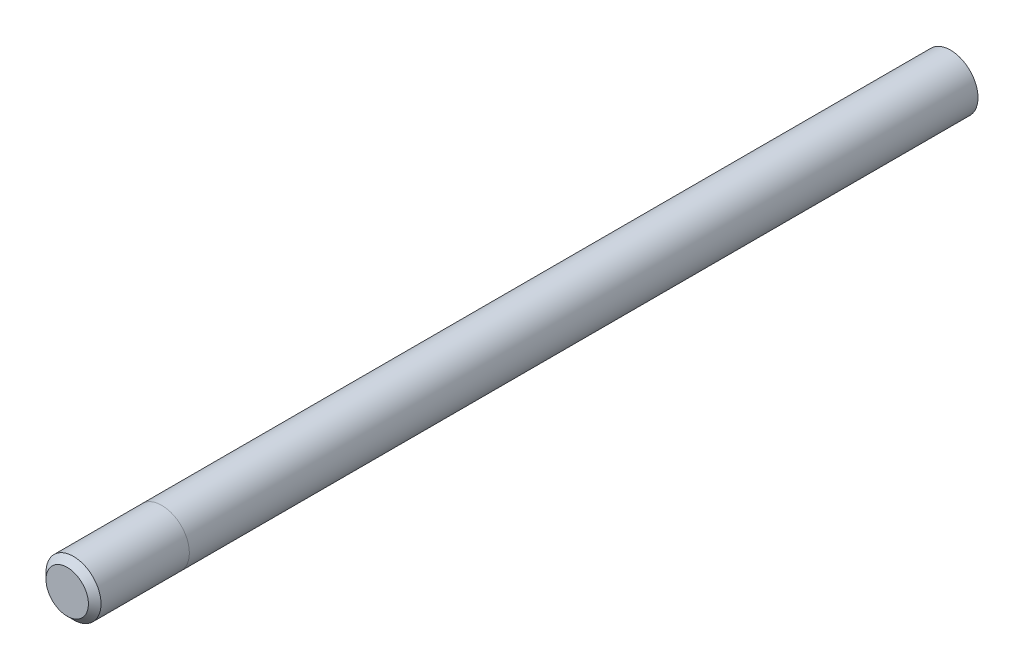
ISO-10303-21;
HEADER;
FILE_DESCRIPTION(('STEP AP214'),'2;1');
FILE_NAME('part.step','',(''),(''),'','','');
FILE_SCHEMA(('AUTOMOTIVE_DESIGN { 1 0 10303 214 1 1 1 1 }'));
ENDSEC;
DATA;
#1=APPLICATION_CONTEXT('core data for automotive mechanical design processes');
#2=APPLICATION_PROTOCOL_DEFINITION('international standard','automotive_design',2000,#1);
#3=PRODUCT_CONTEXT('',#1,'mechanical');
#4=PRODUCT('Part','Part','',(#3));
#5=PRODUCT_RELATED_PRODUCT_CATEGORY('part','',(#4));
#6=PRODUCT_DEFINITION_FORMATION('','',#4);
#7=PRODUCT_DEFINITION_CONTEXT('part definition',#1,'design');
#8=PRODUCT_DEFINITION('design','',#6,#7);
#9=PRODUCT_DEFINITION_SHAPE('','',#8);
#10=(LENGTH_UNIT() NAMED_UNIT(*) SI_UNIT(.MILLI.,.METRE.));
#11=(NAMED_UNIT(*) PLANE_ANGLE_UNIT() SI_UNIT($,.RADIAN.));
#12=(NAMED_UNIT(*) SI_UNIT($,.STERADIAN.) SOLID_ANGLE_UNIT());
#13=UNCERTAINTY_MEASURE_WITH_UNIT(LENGTH_MEASURE(1.E-05),#10,'distance_accuracy_value','');
#14=(GEOMETRIC_REPRESENTATION_CONTEXT(3) GLOBAL_UNCERTAINTY_ASSIGNED_CONTEXT((#13)) GLOBAL_UNIT_ASSIGNED_CONTEXT((#10,
#11,#12)) REPRESENTATION_CONTEXT('',''));
#15=CARTESIAN_POINT('',(0.,0.,0.));
#16=DIRECTION('',(0.,0.,1.));
#17=DIRECTION('',(1.,0.,0.));
#18=AXIS2_PLACEMENT_3D('',#15,#16,#17);
#19=CARTESIAN_POINT('',(0.,0.,177.8));
#20=DIRECTION('',(0.,0.,-1.));
#21=DIRECTION('',(-1.,0.,0.));
#22=AXIS2_PLACEMENT_3D('',#19,#20,#21);
#23=CYLINDRICAL_SURFACE('',#22,5.5372);
#24=CARTESIAN_POINT('',(0.,0.,176.53));
#25=DIRECTION('',(0.,0.,1.));
#26=DIRECTION('',(1.,0.,0.));
#27=AXIS2_PLACEMENT_3D('',#24,#25,#26);
#28=CIRCLE('',#27,5.5372);
#29=CARTESIAN_POINT('',(5.5372,0.,176.53));
#30=VERTEX_POINT('',#29);
#31=EDGE_CURVE('E11',#30,#30,#28,.F.);
#32=ORIENTED_EDGE('',*,*,#31,.T.);
#33=EDGE_LOOP('',(#32));
#34=FACE_BOUND('',#33,.T.);
#35=CARTESIAN_POINT('',(0.,0.,158.75));
#36=DIRECTION('',(0.,0.,1.));
#37=DIRECTION('',(1.,0.,0.));
#38=AXIS2_PLACEMENT_3D('',#35,#36,#37);
#39=CIRCLE('',#38,5.5372);
#40=CARTESIAN_POINT('',(5.5372,0.,158.75));
#41=VERTEX_POINT('',#40);
#42=EDGE_CURVE('E51',#41,#41,#39,.T.);
#43=ORIENTED_EDGE('',*,*,#42,.T.);
#44=EDGE_LOOP('',(#43));
#45=FACE_BOUND('',#44,.T.);
#46=ADVANCED_FACE('F40',(#34,#45),#23,.T.);
#47=CARTESIAN_POINT('',(0.,0.,177.8));
#48=DIRECTION('',(0.,0.,1.));
#49=DIRECTION('',(1.,0.,0.));
#50=AXIS2_PLACEMENT_3D('',#47,#48,#49);
#51=PLANE('',#50);
#52=CARTESIAN_POINT('',(0.,0.,177.8));
#53=DIRECTION('',(0.,0.,1.));
#54=DIRECTION('',(1.,0.,0.));
#55=AXIS2_PLACEMENT_3D('',#52,#53,#54);
#56=CIRCLE('',#55,4.26720000000002);
#57=CARTESIAN_POINT('',(4.26720000000002,0.,177.8));
#58=VERTEX_POINT('',#57);
#59=EDGE_CURVE('E47',#58,#58,#56,.T.);
#60=ORIENTED_EDGE('',*,*,#59,.T.);
#61=EDGE_LOOP('',(#60));
#62=FACE_BOUND('',#61,.T.);
#63=ADVANCED_FACE('F61',(#62),#51,.T.);
#64=CARTESIAN_POINT('',(0.,0.,158.75));
#65=DIRECTION('',(0.,0.,1.));
#66=DIRECTION('',(1.,0.,0.));
#67=AXIS2_PLACEMENT_3D('',#64,#65,#66);
#68=PLANE('',#67);
#69=ORIENTED_EDGE('',*,*,#42,.F.);
#70=EDGE_LOOP('',(#69));
#71=FACE_BOUND('',#70,.T.);
#72=ADVANCED_FACE('F59',(#71),#68,.F.);
#73=CARTESIAN_POINT('',(0.,0.,177.8));
#74=DIRECTION('',(0.,0.,-1.));
#75=DIRECTION('',(-1.,0.,0.));
#76=AXIS2_PLACEMENT_3D('',#73,#74,#75);
#77=CONICAL_SURFACE('',#76,4.26720000000002,0.785398163397442);
#78=ORIENTED_EDGE('',*,*,#31,.F.);
#79=EDGE_LOOP('',(#78));
#80=FACE_BOUND('',#79,.T.);
#81=ORIENTED_EDGE('',*,*,#59,.F.);
#82=EDGE_LOOP('',(#81));
#83=FACE_BOUND('',#82,.T.);
#84=ADVANCED_FACE('F42',(#80,#83),#77,.T.);
#85=CLOSED_SHELL('',(#46,#63,#72,#84));
#86=MANIFOLD_SOLID_BREP('B2',#85);
#87=CARTESIAN_POINT('',(0.,0.,158.75));
#88=DIRECTION('',(0.,0.,-1.));
#89=DIRECTION('',(-1.,0.,0.));
#90=AXIS2_PLACEMENT_3D('',#87,#88,#89);
#91=CYLINDRICAL_SURFACE('',#90,5.5372);
#92=CARTESIAN_POINT('',(0.,0.,158.75));
#93=DIRECTION('',(0.,0.,1.));
#94=DIRECTION('',(1.,0.,0.));
#95=AXIS2_PLACEMENT_3D('',#92,#93,#94);
#96=CIRCLE('',#95,5.5372);
#97=CARTESIAN_POINT('',(5.5372,0.,158.75));
#98=VERTEX_POINT('',#97);
#99=EDGE_CURVE('E39',#98,#98,#96,.T.);
#100=ORIENTED_EDGE('',*,*,#99,.F.);
#101=EDGE_LOOP('',(#100));
#102=FACE_BOUND('',#101,.T.);
#103=CARTESIAN_POINT('',(0.,0.,0.));
#104=DIRECTION('',(0.,0.,1.));
#105=DIRECTION('',(1.,0.,0.));
#106=AXIS2_PLACEMENT_3D('',#103,#104,#105);
#107=CIRCLE('',#106,5.5372);
#108=CARTESIAN_POINT('',(5.5372,0.,0.));
#109=VERTEX_POINT('',#108);
#110=EDGE_CURVE('E98',#109,#109,#107,.T.);
#111=ORIENTED_EDGE('',*,*,#110,.T.);
#112=EDGE_LOOP('',(#111));
#113=FACE_BOUND('',#112,.T.);
#114=ADVANCED_FACE('F95',(#102,#113),#91,.T.);
#115=CARTESIAN_POINT('',(0.,0.,158.75));
#116=DIRECTION('',(0.,0.,1.));
#117=DIRECTION('',(1.,0.,0.));
#118=AXIS2_PLACEMENT_3D('',#115,#116,#117);
#119=PLANE('',#118);
#120=ORIENTED_EDGE('',*,*,#99,.T.);
#121=EDGE_LOOP('',(#120));
#122=FACE_BOUND('',#121,.T.);
#123=ADVANCED_FACE('F111',(#122),#119,.T.);
#124=CARTESIAN_POINT('',(0.,0.,0.));
#125=DIRECTION('',(0.,0.,1.));
#126=DIRECTION('',(1.,0.,0.));
#127=AXIS2_PLACEMENT_3D('',#124,#125,#126);
#128=PLANE('',#127);
#129=ORIENTED_EDGE('',*,*,#110,.F.);
#130=EDGE_LOOP('',(#129));
#131=FACE_BOUND('',#130,.T.);
#132=ADVANCED_FACE('F109',(#131),#128,.F.);
#133=CLOSED_SHELL('',(#114,#123,#132));
#134=MANIFOLD_SOLID_BREP('B6',#133);
#135=ADVANCED_BREP_SHAPE_REPRESENTATION('',(#18,#86,#134),#14);
#136=SHAPE_DEFINITION_REPRESENTATION(#9,#135);
ENDSEC;
END-ISO-10303-21;
